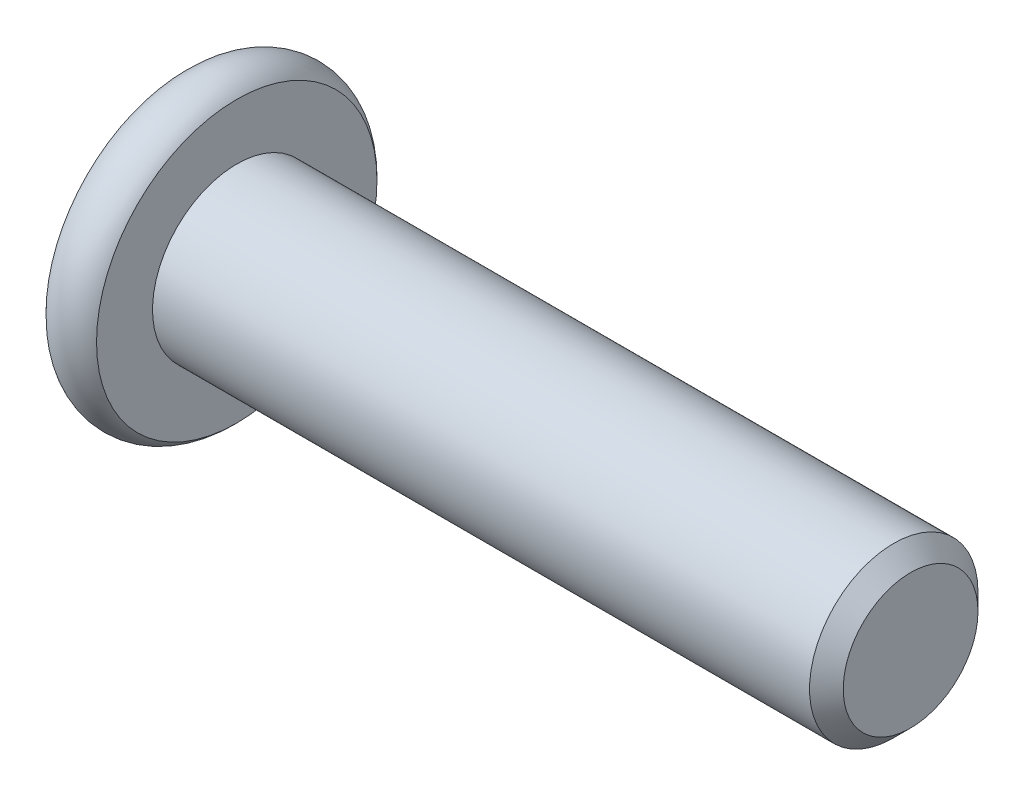
ISO-10303-21;
HEADER;
FILE_DESCRIPTION(('STEP AP214'),'2;1');
FILE_NAME('part.step','',(''),(''),'','','');
FILE_SCHEMA(('AUTOMOTIVE_DESIGN { 1 0 10303 214 1 1 1 1 }'));
ENDSEC;
DATA;
#1=APPLICATION_CONTEXT('core data for automotive mechanical design processes');
#2=APPLICATION_PROTOCOL_DEFINITION('international standard','automotive_design',2000,#1);
#3=PRODUCT_CONTEXT('',#1,'mechanical');
#4=PRODUCT('Part','Part','',(#3));
#5=PRODUCT_RELATED_PRODUCT_CATEGORY('part','',(#4));
#6=PRODUCT_DEFINITION_FORMATION('','',#4);
#7=PRODUCT_DEFINITION_CONTEXT('part definition',#1,'design');
#8=PRODUCT_DEFINITION('design','',#6,#7);
#9=PRODUCT_DEFINITION_SHAPE('','',#8);
#10=(LENGTH_UNIT() NAMED_UNIT(*) SI_UNIT(.MILLI.,.METRE.));
#11=(NAMED_UNIT(*) PLANE_ANGLE_UNIT() SI_UNIT($,.RADIAN.));
#12=(NAMED_UNIT(*) SI_UNIT($,.STERADIAN.) SOLID_ANGLE_UNIT());
#13=UNCERTAINTY_MEASURE_WITH_UNIT(LENGTH_MEASURE(1.E-05),#10,'distance_accuracy_value','');
#14=(GEOMETRIC_REPRESENTATION_CONTEXT(3) GLOBAL_UNCERTAINTY_ASSIGNED_CONTEXT((#13)) GLOBAL_UNIT_ASSIGNED_CONTEXT((#10,
#11,#12)) REPRESENTATION_CONTEXT('',''));
#15=CARTESIAN_POINT('',(0.,0.,0.));
#16=DIRECTION('',(0.,0.,1.));
#17=DIRECTION('',(1.,0.,0.));
#18=AXIS2_PLACEMENT_3D('',#15,#16,#17);
#19=CARTESIAN_POINT('',(-20.,0.,0.));
#20=DIRECTION('',(1.,0.,0.));
#21=DIRECTION('',(0.,0.,-1.));
#22=AXIS2_PLACEMENT_3D('',#19,#20,#21);
#23=CYLINDRICAL_SURFACE('',#22,2.5);
#24=CARTESIAN_POINT('',(-0.5,0.,0.));
#25=DIRECTION('',(1.,0.,0.));
#26=DIRECTION('',(0.,0.,-1.));
#27=AXIS2_PLACEMENT_3D('',#24,#25,#26);
#28=CIRCLE('',#27,2.5);
#29=CARTESIAN_POINT('',(-0.5,0.,-2.5));
#30=VERTEX_POINT('',#29);
#31=EDGE_CURVE('E50',#30,#30,#28,.F.);
#32=ORIENTED_EDGE('',*,*,#31,.T.);
#33=EDGE_LOOP('',(#32));
#34=FACE_BOUND('',#33,.T.);
#35=CARTESIAN_POINT('',(-20.,0.,0.));
#36=DIRECTION('',(-1.,0.,0.));
#37=DIRECTION('',(0.,-1.,0.));
#38=AXIS2_PLACEMENT_3D('',#35,#36,#37);
#39=CIRCLE('',#38,2.5);
#40=CARTESIAN_POINT('',(-20.,-2.50000000000001,0.));
#41=VERTEX_POINT('',#40);
#42=EDGE_CURVE('E126',#41,#41,#39,.F.);
#43=ORIENTED_EDGE('',*,*,#42,.T.);
#44=EDGE_LOOP('',(#43));
#45=FACE_BOUND('',#44,.T.);
#46=ADVANCED_FACE('F36',(#34,#45),#23,.T.);
#47=CARTESIAN_POINT('',(0.,0.,0.));
#48=DIRECTION('',(1.,0.,0.));
#49=DIRECTION('',(0.,0.,-1.));
#50=AXIS2_PLACEMENT_3D('',#47,#48,#49);
#51=PLANE('',#50);
#52=CARTESIAN_POINT('',(0.,0.,0.));
#53=DIRECTION('',(1.,0.,0.));
#54=DIRECTION('',(0.,0.,-1.));
#55=AXIS2_PLACEMENT_3D('',#52,#53,#54);
#56=CIRCLE('',#55,2.);
#57=CARTESIAN_POINT('',(0.,0.,-2.));
#58=VERTEX_POINT('',#57);
#59=EDGE_CURVE('E129',#58,#58,#56,.T.);
#60=ORIENTED_EDGE('',*,*,#59,.T.);
#61=EDGE_LOOP('',(#60));
#62=FACE_BOUND('',#61,.T.);
#63=ADVANCED_FACE('F139',(#62),#51,.T.);
#64=CARTESIAN_POINT('',(0.,0.,0.));
#65=DIRECTION('',(-1.,0.,0.));
#66=DIRECTION('',(0.,0.,1.));
#67=AXIS2_PLACEMENT_3D('',#64,#65,#66);
#68=CONICAL_SURFACE('',#67,2.,0.785398163397446);
#69=ORIENTED_EDGE('',*,*,#31,.F.);
#70=EDGE_LOOP('',(#69));
#71=FACE_BOUND('',#70,.T.);
#72=ORIENTED_EDGE('',*,*,#59,.F.);
#73=EDGE_LOOP('',(#72));
#74=FACE_BOUND('',#73,.T.);
#75=ADVANCED_FACE('F38',(#71,#74),#68,.T.);
#76=CARTESIAN_POINT('',(-21.5,0.,0.));
#77=DIRECTION('',(1.,0.,0.));
#78=DIRECTION('',(0.,1.,0.));
#79=AXIS2_PLACEMENT_3D('',#76,#77,#78);
#80=PLANE('',#79);
#81=CARTESIAN_POINT('',(-21.5,0.,0.));
#82=DIRECTION('',(-1.,0.,0.));
#83=DIRECTION('',(0.,-1.,0.));
#84=AXIS2_PLACEMENT_3D('',#81,#82,#83);
#85=CIRCLE('',#84,1.78205080756886);
#86=CARTESIAN_POINT('',(-21.5,-1.78205080756877,0.));
#87=VERTEX_POINT('',#86);
#88=EDGE_CURVE('E244',#87,#87,#85,.T.);
#89=ORIENTED_EDGE('',*,*,#88,.F.);
#90=EDGE_LOOP('',(#89));
#91=FACE_BOUND('',#90,.T.);
#92=CARTESIAN_POINT('',(-21.5,0.,0.));
#93=DIRECTION('',(-1.,0.,0.));
#94=DIRECTION('',(0.,-1.,0.));
#95=AXIS2_PLACEMENT_3D('',#92,#93,#94);
#96=CIRCLE('',#95,4.16143782776615);
#97=CARTESIAN_POINT('',(-21.5,-4.16143782776614,0.));
#98=VERTEX_POINT('',#97);
#99=EDGE_CURVE('E123',#98,#98,#96,.T.);
#100=ORIENTED_EDGE('',*,*,#99,.T.);
#101=EDGE_LOOP('',(#100));
#102=FACE_BOUND('',#101,.T.);
#103=ADVANCED_FACE('F138',(#91,#102),#80,.F.);
#104=CARTESIAN_POINT('',(-20.75,0.,0.));
#105=DIRECTION('',(-1.,0.,0.));
#106=DIRECTION('',(0.,-1.,0.));
#107=AXIS2_PLACEMENT_3D('',#104,#105,#106);
#108=TOROIDAL_SURFACE('',#107,3.5,1.);
#109=ORIENTED_EDGE('',*,*,#99,.F.);
#110=EDGE_LOOP('',(#109));
#111=FACE_BOUND('',#110,.T.);
#112=CARTESIAN_POINT('',(-20.,0.,0.));
#113=DIRECTION('',(-1.,0.,0.));
#114=DIRECTION('',(0.,-1.,0.));
#115=AXIS2_PLACEMENT_3D('',#112,#113,#114);
#116=CIRCLE('',#115,4.16143782776615);
#117=CARTESIAN_POINT('',(-20.,-4.16143782776615,0.));
#118=VERTEX_POINT('',#117);
#119=EDGE_CURVE('E120',#118,#118,#116,.T.);
#120=ORIENTED_EDGE('',*,*,#119,.T.);
#121=EDGE_LOOP('',(#120));
#122=FACE_BOUND('',#121,.T.);
#123=ADVANCED_FACE('F150',(#111,#122),#108,.T.);
#124=CARTESIAN_POINT('',(-20.,4.16143782776615,0.));
#125=DIRECTION('',(-1.,0.,0.));
#126=DIRECTION('',(0.,-1.,0.));
#127=AXIS2_PLACEMENT_3D('',#124,#125,#126);
#128=PLANE('',#127);
#129=ORIENTED_EDGE('',*,*,#42,.F.);
#130=EDGE_LOOP('',(#129));
#131=FACE_BOUND('',#130,.T.);
#132=ORIENTED_EDGE('',*,*,#119,.F.);
#133=EDGE_LOOP('',(#132));
#134=FACE_BOUND('',#133,.T.);
#135=ADVANCED_FACE('F154',(#131,#134),#128,.F.);
#136=CARTESIAN_POINT('',(-21.5,0.,0.));
#137=DIRECTION('',(-1.,0.,0.));
#138=DIRECTION('',(0.,-1.,0.));
#139=AXIS2_PLACEMENT_3D('',#136,#137,#138);
#140=CONICAL_SURFACE('',#139,1.78205080756886,0.78539816339745);
#141=ORIENTED_EDGE('',*,*,#88,.T.);
#142=EDGE_LOOP('',(#141));
#143=FACE_BOUND('',#142,.T.);
#144=CARTESIAN_POINT('',(-22.015428085613,-1.74023253176573,1.5));
#145=CARTESIAN_POINT('',(-21.9833811073445,-1.69791724929727,1.5));
#146=CARTESIAN_POINT('',(-21.9516444672841,-1.65536760966788,1.5));
#147=CARTESIAN_POINT('',(-21.8889203936153,-1.56970398156681,1.5));
#148=CARTESIAN_POINT('',(-21.85793314822,-1.52658985542845,1.5));
#149=CARTESIAN_POINT('',(-21.765846164345,-1.39562626326559,1.5));
#150=CARTESIAN_POINT('',(-21.7061145123021,-1.30679868010572,1.5));
#151=CARTESIAN_POINT('',(-21.5887342891012,-1.12044622640211,1.5));
#152=CARTESIAN_POINT('',(-21.5314082774823,-1.02271587306669,1.5));
#153=CARTESIAN_POINT('',(-21.426463214976,-0.822357214965219,1.5));
#154=CARTESIAN_POINT('',(-21.3788114236896,-0.719746931701882,1.5));
#155=CARTESIAN_POINT('',(-21.320509988315,-0.565852387095054,1.5));
#156=CARTESIAN_POINT('',(-21.3037990535409,-0.516874191424642,1.5));
#157=CARTESIAN_POINT('',(-21.2743077515089,-0.41772398845748,1.5));
#158=CARTESIAN_POINT('',(-21.2615276514219,-0.367551900263847,1.5));
#159=CARTESIAN_POINT('',(-21.2407784202458,-0.267158299056097,1.5));
#160=CARTESIAN_POINT('',(-21.2327260618259,-0.216954261864833,1.5));
#161=CARTESIAN_POINT('',(-21.221591636834,-0.115994915871297,1.5));
#162=CARTESIAN_POINT('',(-21.2185086886377,-0.0652397064615148,1.5));
#163=CARTESIAN_POINT('',(-21.2175473897404,0.0344222234875812,1.5));
#164=CARTESIAN_POINT('',(-21.2194789216952,0.0833271701101152,1.5));
#165=CARTESIAN_POINT('',(-21.2280175729677,0.180724293127248,1.5));
#166=CARTESIAN_POINT('',(-21.234625142048,0.229216429361756,1.5));
#167=CARTESIAN_POINT('',(-21.2522650626447,0.326258027697034,1.5));
#168=CARTESIAN_POINT('',(-21.263373168201,0.374793507450053,1.5));
#169=CARTESIAN_POINT('',(-21.2894198669595,0.470802295834207,1.5));
#170=CARTESIAN_POINT('',(-21.3043581560035,0.518275688481311,1.5));
#171=CARTESIAN_POINT('',(-21.356839545716,0.667150562065161,1.5));
#172=CARTESIAN_POINT('',(-21.4003351165442,0.766448362426881,1.5));
#173=CARTESIAN_POINT('',(-21.4970587814836,0.960384405673869,1.5));
#174=CARTESIAN_POINT('',(-21.5503217226675,1.05500437383624,1.5));
#175=CARTESIAN_POINT('',(-21.6602258010453,1.23584520321535,1.5));
#176=CARTESIAN_POINT('',(-21.7165682531046,1.32224986946553,1.5));
#177=CARTESIAN_POINT('',(-21.803675572597,1.44954953726477,1.5));
#178=CARTESIAN_POINT('',(-21.8330199906839,1.49143368482427,1.5));
#179=CARTESIAN_POINT('',(-21.8924869182931,1.57462914783248,1.5));
#180=CARTESIAN_POINT('',(-21.9226092115007,1.61594061772583,1.5));
#181=CARTESIAN_POINT('',(-21.9530541181366,1.65701358742556,1.5));
#182=B_SPLINE_CURVE_WITH_KNOTS('',3,(#144,#145,#146,#147,#148,#149,#150,#151,#152,#153,#154,
#155,#156,#157,#158,#159,#160,#161,#162,#163,#164,#165,#166,#167,#168,#169,#170,#171,#172,#173,
#174,#175,#176,#177,#178,#179,#180,#181),.UNSPECIFIED.,.F.,.F.,(4,2,2,2,2,2,2,2,2,2,2,2,2,2,2,2,
2,2,4),(0.,0.159238974218354,0.318517535014543,0.639504781932386,0.979137893799193,
1.31760168934357,1.47272233841624,1.62785352839775,1.78016486537346,1.93244917778279,
2.07904486260297,2.22565464958332,2.37484213303399,2.52401777304039,2.84828365283775,
3.1737297566675,3.48303030530537,3.63644667013909,3.78982082222913),.UNSPECIFIED.);
#183=CARTESIAN_POINT('',(-21.45,-0.866025403784357,1.5));
#184=VERTEX_POINT('',#183);
#185=CARTESIAN_POINT('',(-21.45,0.866025403784521,1.5));
#186=VERTEX_POINT('',#185);
#187=EDGE_CURVE('E104',#184,#186,#182,.T.);
#188=ORIENTED_EDGE('',*,*,#187,.F.);
#189=CARTESIAN_POINT('',(-21.4501154816001,-1.73216627762263,-0.0002000000000008));
#190=CARTESIAN_POINT('',(-21.4203654760674,-1.70239359975907,0.0513677907370744));
#191=CARTESIAN_POINT('',(-21.3923624839103,-1.67212305186347,0.103797917665199));
#192=CARTESIAN_POINT('',(-21.3410892304402,-1.61039789003611,0.210709034055595));
#193=CARTESIAN_POINT('',(-21.3178475050444,-1.57893740312606,0.26520019581466));
#194=CARTESIAN_POINT('',(-21.2780337289922,-1.51549879897979,0.375079081357248));
#195=CARTESIAN_POINT('',(-21.2613615856709,-1.48353684526802,0.430438809095199));
#196=CARTESIAN_POINT('',(-21.2356744568181,-1.41890915196203,0.54237725747715));
#197=CARTESIAN_POINT('',(-21.2266402904789,-1.3862453878111,0.598952556553009));
#198=CARTESIAN_POINT('',(-21.2184890812269,-1.32995210095291,0.696455389516442));
#199=CARTESIAN_POINT('',(-21.2172822529892,-1.30639533311116,0.737256908280467));
#200=CARTESIAN_POINT('',(-21.2193140571623,-1.25932335290185,0.818787969615859));
#201=CARTESIAN_POINT('',(-21.2225536707483,-1.23580815085305,0.859517494314631));
#202=CARTESIAN_POINT('',(-21.233291985982,-1.18900414978418,0.940584402163417));
#203=CARTESIAN_POINT('',(-21.2407946530188,-1.16571558211711,0.980921384598289));
#204=CARTESIAN_POINT('',(-21.2596516119283,-1.11952932016327,1.06091833691403));
#205=CARTESIAN_POINT('',(-21.2710075570186,-1.09663179808778,1.10057800851621));
#206=CARTESIAN_POINT('',(-21.3047216475927,-1.0379815980969,1.20216313477449));
#207=CARTESIAN_POINT('',(-21.3296218490934,-1.00259267147457,1.26345855370969));
#208=CARTESIAN_POINT('',(-21.3716566532716,-0.950557780604292,1.35358562846331));
#209=CARTESIAN_POINT('',(-21.3864251535591,-0.933410759677065,1.38328513990772));
#210=CARTESIAN_POINT('',(-21.4173105659402,-0.899432101996325,1.44213790138375));
#211=CARTESIAN_POINT('',(-21.4334268341217,-0.882600319285629,1.47129140422064));
#212=CARTESIAN_POINT('',(-21.4501154816001,-0.865909933730519,1.5002));
#213=B_SPLINE_CURVE_WITH_KNOTS('',3,(#189,#190,#191,#192,#193,#194,#195,#196,#197,#198,#199,
#200,#201,#202,#203,#204,#205,#206,#207,#208,#209,#210,#211,#212),.UNSPECIFIED.,.F.,.F.,(4,2,2,
2,2,2,2,2,2,2,2,4),(0.,0.199829143693305,0.400822987382389,0.598623720538181,0.795926240188891,
0.937113067959883,1.07833105577193,1.21968061668222,1.36109089931055,1.58570969637566,
1.69770705470964,1.80965120737194),.UNSPECIFIED.);
#214=CARTESIAN_POINT('',(-21.45,-1.73205080756879,0.));
#215=VERTEX_POINT('',#214);
#216=EDGE_CURVE('E200',#215,#184,#213,.T.);
#217=ORIENTED_EDGE('',*,*,#216,.F.);
#218=CARTESIAN_POINT('',(-21.4501154816001,-0.865909933730519,-1.5002));
#219=CARTESIAN_POINT('',(-21.4203654760674,-0.895682611594084,-1.44863220926292));
#220=CARTESIAN_POINT('',(-21.3923624839103,-0.925953159489683,-1.3962020823348));
#221=CARTESIAN_POINT('',(-21.3410892304402,-0.987678321317041,-1.2892909659444));
#222=CARTESIAN_POINT('',(-21.3178475050444,-1.01913880822709,-1.23479980418534));
#223=CARTESIAN_POINT('',(-21.2780337289922,-1.08257741237336,-1.12492091864275));
#224=CARTESIAN_POINT('',(-21.2613615856709,-1.11453936608513,-1.0695611909048));
#225=CARTESIAN_POINT('',(-21.2356744568181,-1.17916705939112,-0.957622742522851));
#226=CARTESIAN_POINT('',(-21.2266402904789,-1.21183082354205,-0.901047443446993));
#227=CARTESIAN_POINT('',(-21.2184890812269,-1.26812411040024,-0.80354461048356));
#228=CARTESIAN_POINT('',(-21.2172822529892,-1.291680878242,-0.762743091719535));
#229=CARTESIAN_POINT('',(-21.2193140571623,-1.3387528584513,-0.681212030384143));
#230=CARTESIAN_POINT('',(-21.2225536707483,-1.3622680605001,-0.640482505685371));
#231=CARTESIAN_POINT('',(-21.233291985982,-1.40907206156897,-0.559415597836585));
#232=CARTESIAN_POINT('',(-21.2407946530188,-1.43236062923604,-0.519078615401714));
#233=CARTESIAN_POINT('',(-21.2596516119283,-1.47854689118988,-0.439081663085971));
#234=CARTESIAN_POINT('',(-21.2710075570186,-1.50144441326537,-0.399421991483794));
#235=CARTESIAN_POINT('',(-21.3047216475927,-1.56009461325625,-0.297836865225517));
#236=CARTESIAN_POINT('',(-21.3296218490934,-1.59548353987858,-0.236541446290313));
#237=CARTESIAN_POINT('',(-21.3716566532716,-1.64751843074886,-0.146414371536688));
#238=CARTESIAN_POINT('',(-21.3864251535591,-1.66466545167609,-0.116714860092285));
#239=CARTESIAN_POINT('',(-21.4173105659402,-1.69864410935683,-0.0578620986162509));
#240=CARTESIAN_POINT('',(-21.4334268341217,-1.71547589206752,-0.0287085957793639));
#241=CARTESIAN_POINT('',(-21.4501154816001,-1.73216627762263,0.00019999999999943));
#242=B_SPLINE_CURVE_WITH_KNOTS('',3,(#218,#219,#220,#221,#222,#223,#224,#225,#226,#227,#228,
#229,#230,#231,#232,#233,#234,#235,#236,#237,#238,#239,#240,#241),.UNSPECIFIED.,.F.,.F.,(4,2,2,
2,2,2,2,2,2,2,2,4),(0.,0.199829143693304,0.400822987382386,0.598623720538178,0.795926240188888,
0.937113067959879,1.07833105577193,1.21968061668222,1.36109089931054,1.58570969637565,
1.69770705470963,1.80965120737194),.UNSPECIFIED.);
#243=CARTESIAN_POINT('',(-21.45,-0.866025403784356,-1.5));
#244=VERTEX_POINT('',#243);
#245=EDGE_CURVE('E194',#244,#215,#242,.T.);
#246=ORIENTED_EDGE('',*,*,#245,.F.);
#247=CARTESIAN_POINT('',(-22.0154280857208,-1.74023253190806,-1.5));
#248=CARTESIAN_POINT('',(-21.9833811074482,-1.69791724943558,-1.5));
#249=CARTESIAN_POINT('',(-21.9516444673836,-1.65536760980217,-1.5));
#250=CARTESIAN_POINT('',(-21.8889203937065,-1.569703981693,-1.5));
#251=CARTESIAN_POINT('',(-21.8579331483071,-1.52658985555058,-1.5));
#252=CARTESIAN_POINT('',(-21.7658461644196,-1.39562626337528,-1.5));
#253=CARTESIAN_POINT('',(-21.7061145123685,-1.30679868020694,-1.5));
#254=CARTESIAN_POINT('',(-21.5887342891506,-1.12044622648488,-1.5));
#255=CARTESIAN_POINT('',(-21.5314082775229,-1.02271587313942,-1.5));
#256=CARTESIAN_POINT('',(-21.4264632150005,-0.822357215017008,-1.5));
#257=CARTESIAN_POINT('',(-21.3788114237068,-0.719746931742781,-1.5));
#258=CARTESIAN_POINT('',(-21.3205099883267,-0.565852387127772,-1.5));
#259=CARTESIAN_POINT('',(-21.3037990535528,-0.516874191460807,-1.5));
#260=CARTESIAN_POINT('',(-21.2743077515206,-0.417723988500656,-1.5));
#261=CARTESIAN_POINT('',(-21.2615276514332,-0.367551900310585,-1.5));
#262=CARTESIAN_POINT('',(-21.2407784202553,-0.267158299109846,-1.5));
#263=CARTESIAN_POINT('',(-21.2327260618343,-0.216954261922027,-1.5));
#264=CARTESIAN_POINT('',(-21.2215916368391,-0.11599491593527,-1.5));
#265=CARTESIAN_POINT('',(-21.2185086886407,-0.0652397065288216,-1.5));
#266=CARTESIAN_POINT('',(-21.2175473897388,0.0344222234142057,-1.5));
#267=CARTESIAN_POINT('',(-21.219478921691,0.0833271700339959,-1.5));
#268=CARTESIAN_POINT('',(-21.228017572958,0.18072429304592,-1.5));
#269=CARTESIAN_POINT('',(-21.2346251420354,0.229216429277964,-1.5));
#270=CARTESIAN_POINT('',(-21.2522650626259,0.326258027608378,-1.5));
#271=CARTESIAN_POINT('',(-21.2633731681789,0.374793507359005,-1.5));
#272=CARTESIAN_POINT('',(-21.2894198669309,0.470802295738608,-1.5));
#273=CARTESIAN_POINT('',(-21.3043581559716,0.518275688383553,-1.5));
#274=CARTESIAN_POINT('',(-21.3568395456685,0.667150561946207,-1.5));
#275=CARTESIAN_POINT('',(-21.4003351164824,0.766448362289951,-1.5));
#276=CARTESIAN_POINT('',(-21.4970587813916,0.960384405502367,-1.5));
#277=CARTESIAN_POINT('',(-21.5503217225595,1.05500437364815,-1.5));
#278=CARTESIAN_POINT('',(-21.6602258009069,1.23584520299745,-1.5));
#279=CARTESIAN_POINT('',(-21.7165682529518,1.32224986923429,-1.5));
#280=CARTESIAN_POINT('',(-21.8036755724226,1.44954953701381,-1.5));
#281=CARTESIAN_POINT('',(-21.8330199905024,1.49143368456684,-1.5));
#282=CARTESIAN_POINT('',(-21.8924869180973,1.57462914756214,-1.5));
#283=CARTESIAN_POINT('',(-21.9226092112979,1.61594061744905,-1.5));
#284=CARTESIAN_POINT('',(-21.9530541179266,1.65701358714236,-1.5));
#285=B_SPLINE_CURVE_WITH_KNOTS('',3,(#247,#248,#249,#250,#251,#252,#253,#254,#255,#256,#257,
#258,#259,#260,#261,#262,#263,#264,#265,#266,#267,#268,#269,#270,#271,#272,#273,#274,#275,#276,
#277,#278,#279,#280,#281,#282,#283,#284),.UNSPECIFIED.,.F.,.F.,(4,2,2,2,2,2,2,2,2,2,2,2,2,2,2,2,
2,2,4),(0.,0.159238974235481,0.318517535048797,0.63950478200154,0.979137893907506,
1.31760168949067,1.47272233855334,1.62785352852489,1.78016486549104,1.93244917789081,
2.0790448627025,2.22565464967435,2.37484213311584,2.52401777311309,2.8482836528441,
3.17372975660706,3.4830303051878,3.63644666999334,3.78982082205521),.UNSPECIFIED.);
#286=CARTESIAN_POINT('',(-21.45,0.866025403784521,-1.5));
#287=VERTEX_POINT('',#286);
#288=EDGE_CURVE('E57',#287,#244,#285,.F.);
#289=ORIENTED_EDGE('',*,*,#288,.F.);
#290=CARTESIAN_POINT('',(-21.4501154816001,1.7321662776228,0.00020000000000003));
#291=CARTESIAN_POINT('',(-21.4203654760673,1.70239359975923,-0.0513677907370759));
#292=CARTESIAN_POINT('',(-21.3923624839103,1.67212305186363,-0.103797917665201));
#293=CARTESIAN_POINT('',(-21.3410892304402,1.61039789003627,-0.210709034055597));
#294=CARTESIAN_POINT('',(-21.3178475050444,1.57893740312622,-0.265200195814661));
#295=CARTESIAN_POINT('',(-21.2780337289922,1.51549879897995,-0.375079081357247));
#296=CARTESIAN_POINT('',(-21.2613615856709,1.48353684526818,-0.430438809095198));
#297=CARTESIAN_POINT('',(-21.2356744568181,1.4189091519622,-0.542377257477149));
#298=CARTESIAN_POINT('',(-21.2266402904789,1.38624538781127,-0.598952556553007));
#299=CARTESIAN_POINT('',(-21.2184890812269,1.32995210095308,-0.696455389516439));
#300=CARTESIAN_POINT('',(-21.2172822529892,1.30639533311132,-0.737256908280464));
#301=CARTESIAN_POINT('',(-21.2193140571623,1.25932335290202,-0.818787969615856));
#302=CARTESIAN_POINT('',(-21.2225536707483,1.23580815085322,-0.859517494314628));
#303=CARTESIAN_POINT('',(-21.233291985982,1.18900414978435,-0.940584402163414));
#304=CARTESIAN_POINT('',(-21.2407946530187,1.16571558211728,-0.980921384598287));
#305=CARTESIAN_POINT('',(-21.2596516119283,1.11952932016343,-1.06091833691403));
#306=CARTESIAN_POINT('',(-21.2710075570186,1.09663179808795,-1.10057800851621));
#307=CARTESIAN_POINT('',(-21.3047216475927,1.03798159809707,-1.20216313477448));
#308=CARTESIAN_POINT('',(-21.3296218490934,1.00259267147474,-1.26345855370969));
#309=CARTESIAN_POINT('',(-21.3716566532716,0.950557780604457,-1.35358562846331));
#310=CARTESIAN_POINT('',(-21.3864251535591,0.93341075967723,-1.38328513990772));
#311=CARTESIAN_POINT('',(-21.4173105659402,0.89943210199649,-1.44213790138375));
#312=CARTESIAN_POINT('',(-21.4334268341217,0.882600319285793,-1.47129140422064));
#313=CARTESIAN_POINT('',(-21.4501154816001,0.865909933730683,-1.5002));
#314=B_SPLINE_CURVE_WITH_KNOTS('',3,(#290,#291,#292,#293,#294,#295,#296,#297,#298,#299,#300,
#301,#302,#303,#304,#305,#306,#307,#308,#309,#310,#311,#312,#313),.UNSPECIFIED.,.F.,.F.,(4,2,2,
2,2,2,2,2,2,2,2,4),(0.,0.199829143693305,0.400822987382387,0.598623720538179,0.795926240188887,
0.937113067959879,1.07833105577193,1.21968061668222,1.36109089931054,1.58570969637565,
1.69770705470963,1.80965120737194),.UNSPECIFIED.);
#315=CARTESIAN_POINT('',(-21.45,1.73205080756896,0.));
#316=VERTEX_POINT('',#315);
#317=EDGE_CURVE('E11',#316,#287,#314,.T.);
#318=ORIENTED_EDGE('',*,*,#317,.F.);
#319=CARTESIAN_POINT('',(-21.4501154816001,0.865909933730683,1.5002));
#320=CARTESIAN_POINT('',(-21.4203654760673,0.895682611594248,1.44863220926292));
#321=CARTESIAN_POINT('',(-21.3923624839103,0.925953159489847,1.3962020823348));
#322=CARTESIAN_POINT('',(-21.3410892304402,0.987678321317206,1.2892909659444));
#323=CARTESIAN_POINT('',(-21.3178475050444,1.01913880822726,1.23479980418534));
#324=CARTESIAN_POINT('',(-21.2780337289922,1.08257741237353,1.12492091864275));
#325=CARTESIAN_POINT('',(-21.2613615856709,1.1145393660853,1.0695611909048));
#326=CARTESIAN_POINT('',(-21.2356744568181,1.17916705939129,0.957622742522847));
#327=CARTESIAN_POINT('',(-21.2266402904789,1.21183082354222,0.901047443446989));
#328=CARTESIAN_POINT('',(-21.2184890812269,1.2681241104004,0.803544610483557));
#329=CARTESIAN_POINT('',(-21.2172822529892,1.29168087824216,0.762743091719531));
#330=CARTESIAN_POINT('',(-21.2193140571623,1.33875285845146,0.681212030384139));
#331=CARTESIAN_POINT('',(-21.2225536707483,1.36226806050027,0.640482505685368));
#332=CARTESIAN_POINT('',(-21.233291985982,1.40907206156913,0.559415597836582));
#333=CARTESIAN_POINT('',(-21.2407946530187,1.4323606292362,0.51907861540171));
#334=CARTESIAN_POINT('',(-21.2596516119283,1.47854689119005,0.439081663085967));
#335=CARTESIAN_POINT('',(-21.2710075570186,1.50144441326554,0.39942199148379));
#336=CARTESIAN_POINT('',(-21.3047216475927,1.56009461325641,0.297836865225514));
#337=CARTESIAN_POINT('',(-21.3296218490934,1.59548353987875,0.23654144629031));
#338=CARTESIAN_POINT('',(-21.3716566532716,1.64751843074902,0.146414371536686));
#339=CARTESIAN_POINT('',(-21.3864251535591,1.66466545167625,0.116714860092283));
#340=CARTESIAN_POINT('',(-21.4173105659402,1.69864410935699,0.05786209861625));
#341=CARTESIAN_POINT('',(-21.4334268341217,1.71547589206769,0.0287085957793637));
#342=CARTESIAN_POINT('',(-21.4501154816001,1.7321662776228,-0.000199999999999372));
#343=B_SPLINE_CURVE_WITH_KNOTS('',3,(#319,#320,#321,#322,#323,#324,#325,#326,#327,#328,#329,
#330,#331,#332,#333,#334,#335,#336,#337,#338,#339,#340,#341,#342),.UNSPECIFIED.,.F.,.F.,(4,2,2,
2,2,2,2,2,2,2,2,4),(0.,0.199829143693306,0.40082298738239,0.598623720538183,0.795926240188891,
0.937113067959883,1.07833105577193,1.21968061668222,1.36109089931055,1.58570969637565,
1.69770705470963,1.80965120737193),.UNSPECIFIED.);
#344=EDGE_CURVE('E95',#186,#316,#343,.T.);
#345=ORIENTED_EDGE('',*,*,#344,.F.);
#346=EDGE_LOOP('',(#188,#217,#246,#289,#318,#345));
#347=FACE_BOUND('',#346,.T.);
#348=ADVANCED_FACE('F94',(#143,#347),#140,.F.);
#349=CARTESIAN_POINT('',(-19.2,0.,0.));
#350=DIRECTION('',(-1.,0.,0.));
#351=DIRECTION('',(0.,-1.,0.));
#352=AXIS2_PLACEMENT_3D('',#349,#350,#351);
#353=PLANE('',#352);
#354=DIRECTION('',(0.,0.5,-0.866025403784438));
#355=VECTOR('',#354,1.);
#356=CARTESIAN_POINT('',(-19.2,0.866025403784512,1.5));
#357=LINE('',#356,#355);
#358=CARTESIAN_POINT('',(-19.2,0.866025403784512,1.5));
#359=VERTEX_POINT('',#358);
#360=CARTESIAN_POINT('',(-19.2,1.73205080756895,0.));
#361=VERTEX_POINT('',#360);
#362=EDGE_CURVE('E103',#359,#361,#357,.T.);
#363=ORIENTED_EDGE('',*,*,#362,.T.);
#364=DIRECTION('',(0.,-0.5,-0.866025403784439));
#365=VECTOR('',#364,1.);
#366=CARTESIAN_POINT('',(-19.2,1.73205080756895,0.));
#367=LINE('',#366,#365);
#368=CARTESIAN_POINT('',(-19.2,0.866025403784512,-1.5));
#369=VERTEX_POINT('',#368);
#370=EDGE_CURVE('E108',#361,#369,#367,.T.);
#371=ORIENTED_EDGE('',*,*,#370,.T.);
#372=DIRECTION('',(0.,-1.,0.));
#373=VECTOR('',#372,1.);
#374=CARTESIAN_POINT('',(-19.2,0.866025403784512,-1.5));
#375=LINE('',#374,#373);
#376=CARTESIAN_POINT('',(-19.2,-0.866025403784365,-1.5));
#377=VERTEX_POINT('',#376);
#378=EDGE_CURVE('E226',#369,#377,#375,.T.);
#379=ORIENTED_EDGE('',*,*,#378,.T.);
#380=DIRECTION('',(0.,-0.5,0.866025403784439));
#381=VECTOR('',#380,1.);
#382=CARTESIAN_POINT('',(-19.2,-0.866025403784365,-1.5));
#383=LINE('',#382,#381);
#384=CARTESIAN_POINT('',(-19.2,-1.7320508075688,0.));
#385=VERTEX_POINT('',#384);
#386=EDGE_CURVE('E230',#377,#385,#383,.T.);
#387=ORIENTED_EDGE('',*,*,#386,.T.);
#388=DIRECTION('',(0.,0.5,0.866025403784439));
#389=VECTOR('',#388,1.);
#390=CARTESIAN_POINT('',(-19.2,-1.7320508075688,0.));
#391=LINE('',#390,#389);
#392=CARTESIAN_POINT('',(-19.2,-0.866025403784366,1.5));
#393=VERTEX_POINT('',#392);
#394=EDGE_CURVE('E116',#385,#393,#391,.T.);
#395=ORIENTED_EDGE('',*,*,#394,.T.);
#396=DIRECTION('',(0.,1.,0.));
#397=VECTOR('',#396,1.);
#398=CARTESIAN_POINT('',(-19.2,-0.866025403784366,1.5));
#399=LINE('',#398,#397);
#400=EDGE_CURVE('E111',#393,#359,#399,.T.);
#401=ORIENTED_EDGE('',*,*,#400,.T.);
#402=EDGE_LOOP('',(#363,#371,#379,#387,#395,#401));
#403=FACE_BOUND('',#402,.T.);
#404=ADVANCED_FACE('F180',(#403),#353,.T.);
#405=CARTESIAN_POINT('',(-19.2,1.73205080756895,0.));
#406=DIRECTION('',(0.,0.866025403784439,-0.5));
#407=DIRECTION('',(0.,0.5,0.866025403784439));
#408=AXIS2_PLACEMENT_3D('',#405,#406,#407);
#409=PLANE('',#408);
#410=DIRECTION('',(-1.,0.,0.));
#411=VECTOR('',#410,1.);
#412=CARTESIAN_POINT('',(-19.2,1.73205080756895,0.));
#413=LINE('',#412,#411);
#414=EDGE_CURVE('E101',#361,#316,#413,.T.);
#415=ORIENTED_EDGE('',*,*,#414,.T.);
#416=ORIENTED_EDGE('',*,*,#317,.T.);
#417=DIRECTION('',(-1.,0.,0.));
#418=VECTOR('',#417,1.);
#419=CARTESIAN_POINT('',(-19.2,0.866025403784512,-1.5));
#420=LINE('',#419,#418);
#421=EDGE_CURVE('E110',#369,#287,#420,.T.);
#422=ORIENTED_EDGE('',*,*,#421,.F.);
#423=ORIENTED_EDGE('',*,*,#370,.F.);
#424=EDGE_LOOP('',(#415,#416,#422,#423));
#425=FACE_BOUND('',#424,.T.);
#426=ADVANCED_FACE('F106',(#425),#409,.F.);
#427=CARTESIAN_POINT('',(-19.2,0.866025403784512,-1.5));
#428=DIRECTION('',(0.,0.,-1.));
#429=DIRECTION('',(0.,1.,0.));
#430=AXIS2_PLACEMENT_3D('',#427,#428,#429);
#431=PLANE('',#430);
#432=ORIENTED_EDGE('',*,*,#421,.T.);
#433=ORIENTED_EDGE('',*,*,#288,.T.);
#434=DIRECTION('',(-1.,0.,0.));
#435=VECTOR('',#434,1.);
#436=CARTESIAN_POINT('',(-19.2,-0.866025403784365,-1.5));
#437=LINE('',#436,#435);
#438=EDGE_CURVE('E113',#377,#244,#437,.T.);
#439=ORIENTED_EDGE('',*,*,#438,.F.);
#440=ORIENTED_EDGE('',*,*,#378,.F.);
#441=EDGE_LOOP('',(#432,#433,#439,#440));
#442=FACE_BOUND('',#441,.T.);
#443=ADVANCED_FACE('F215',(#442),#431,.F.);
#444=CARTESIAN_POINT('',(-19.2,-0.866025403784365,-1.5));
#445=DIRECTION('',(0.,-0.866025403784439,-0.5));
#446=DIRECTION('',(0.,0.5,-0.866025403784439));
#447=AXIS2_PLACEMENT_3D('',#444,#445,#446);
#448=PLANE('',#447);
#449=ORIENTED_EDGE('',*,*,#438,.T.);
#450=ORIENTED_EDGE('',*,*,#245,.T.);
#451=DIRECTION('',(-1.,0.,0.));
#452=VECTOR('',#451,1.);
#453=CARTESIAN_POINT('',(-19.2,-1.7320508075688,0.));
#454=LINE('',#453,#452);
#455=EDGE_CURVE('E240',#385,#215,#454,.T.);
#456=ORIENTED_EDGE('',*,*,#455,.F.);
#457=ORIENTED_EDGE('',*,*,#386,.F.);
#458=EDGE_LOOP('',(#449,#450,#456,#457));
#459=FACE_BOUND('',#458,.T.);
#460=ADVANCED_FACE('F210',(#459),#448,.F.);
#461=CARTESIAN_POINT('',(-19.2,-1.7320508075688,0.));
#462=DIRECTION('',(0.,-0.866025403784439,0.5));
#463=DIRECTION('',(0.,-0.5,-0.866025403784439));
#464=AXIS2_PLACEMENT_3D('',#461,#462,#463);
#465=PLANE('',#464);
#466=ORIENTED_EDGE('',*,*,#455,.T.);
#467=ORIENTED_EDGE('',*,*,#216,.T.);
#468=DIRECTION('',(-1.,0.,0.));
#469=VECTOR('',#468,1.);
#470=CARTESIAN_POINT('',(-19.2,-0.866025403784366,1.5));
#471=LINE('',#470,#469);
#472=EDGE_CURVE('E237',#393,#184,#471,.T.);
#473=ORIENTED_EDGE('',*,*,#472,.F.);
#474=ORIENTED_EDGE('',*,*,#394,.F.);
#475=EDGE_LOOP('',(#466,#467,#473,#474));
#476=FACE_BOUND('',#475,.T.);
#477=ADVANCED_FACE('F207',(#476),#465,.F.);
#478=CARTESIAN_POINT('',(-19.2,-0.866025403784366,1.5));
#479=DIRECTION('',(0.,0.,1.));
#480=DIRECTION('',(1.,0.,0.));
#481=AXIS2_PLACEMENT_3D('',#478,#479,#480);
#482=PLANE('',#481);
#483=ORIENTED_EDGE('',*,*,#472,.T.);
#484=ORIENTED_EDGE('',*,*,#187,.T.);
#485=DIRECTION('',(-1.,0.,0.));
#486=VECTOR('',#485,1.);
#487=CARTESIAN_POINT('',(-19.2,0.866025403784512,1.5));
#488=LINE('',#487,#486);
#489=EDGE_CURVE('E64',#359,#186,#488,.T.);
#490=ORIENTED_EDGE('',*,*,#489,.F.);
#491=ORIENTED_EDGE('',*,*,#400,.F.);
#492=EDGE_LOOP('',(#483,#484,#490,#491));
#493=FACE_BOUND('',#492,.T.);
#494=ADVANCED_FACE('F161',(#493),#482,.F.);
#495=CARTESIAN_POINT('',(-19.2,0.866025403784512,1.5));
#496=DIRECTION('',(0.,0.866025403784439,0.5));
#497=DIRECTION('',(0.,-0.5,0.866025403784439));
#498=AXIS2_PLACEMENT_3D('',#495,#496,#497);
#499=PLANE('',#498);
#500=ORIENTED_EDGE('',*,*,#489,.T.);
#501=ORIENTED_EDGE('',*,*,#344,.T.);
#502=ORIENTED_EDGE('',*,*,#414,.F.);
#503=ORIENTED_EDGE('',*,*,#362,.F.);
#504=EDGE_LOOP('',(#500,#501,#502,#503));
#505=FACE_BOUND('',#504,.T.);
#506=ADVANCED_FACE('F100',(#505),#499,.F.);
#507=CLOSED_SHELL('',(#46,#63,#75,#103,#123,#135,#348,#404,#426,#443,#460,#477,#494,#506));
#508=MANIFOLD_SOLID_BREP('B2',#507);
#509=ADVANCED_BREP_SHAPE_REPRESENTATION('',(#18,#508),#14);
#510=SHAPE_DEFINITION_REPRESENTATION(#9,#509);
ENDSEC;
END-ISO-10303-21;
